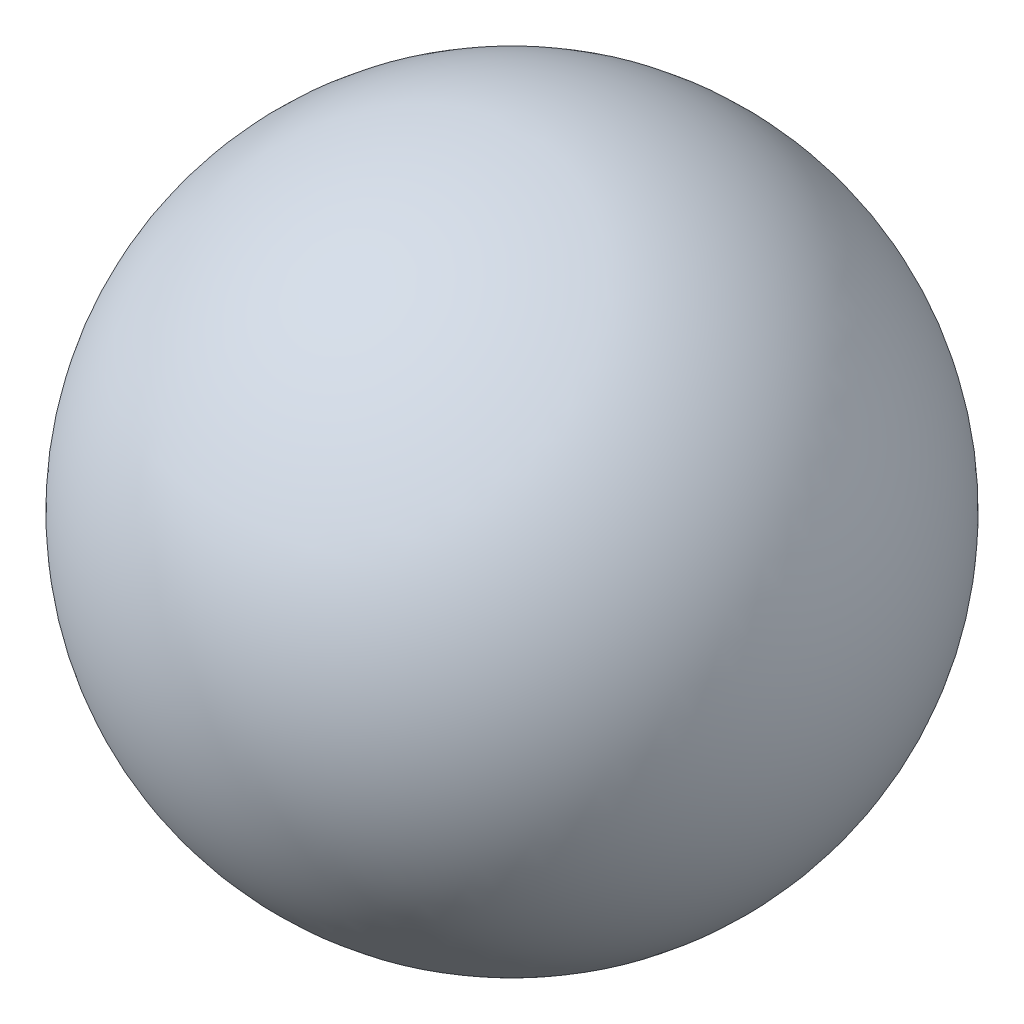
ISO-10303-21;
HEADER;
FILE_DESCRIPTION(('STEP AP214'),'2;1');
FILE_NAME('part.step','',(''),(''),'','','');
FILE_SCHEMA(('AUTOMOTIVE_DESIGN { 1 0 10303 214 1 1 1 1 }'));
ENDSEC;
DATA;
#1=APPLICATION_CONTEXT('core data for automotive mechanical design processes');
#2=APPLICATION_PROTOCOL_DEFINITION('international standard','automotive_design',2000,#1);
#3=PRODUCT_CONTEXT('',#1,'mechanical');
#4=PRODUCT('Part','Part','',(#3));
#5=PRODUCT_RELATED_PRODUCT_CATEGORY('part','',(#4));
#6=PRODUCT_DEFINITION_FORMATION('','',#4);
#7=PRODUCT_DEFINITION_CONTEXT('part definition',#1,'design');
#8=PRODUCT_DEFINITION('design','',#6,#7);
#9=PRODUCT_DEFINITION_SHAPE('','',#8);
#10=(LENGTH_UNIT() NAMED_UNIT(*) SI_UNIT(.MILLI.,.METRE.));
#11=(NAMED_UNIT(*) PLANE_ANGLE_UNIT() SI_UNIT($,.RADIAN.));
#12=(NAMED_UNIT(*) SI_UNIT($,.STERADIAN.) SOLID_ANGLE_UNIT());
#13=UNCERTAINTY_MEASURE_WITH_UNIT(LENGTH_MEASURE(1.E-05),#10,'distance_accuracy_value','');
#14=(GEOMETRIC_REPRESENTATION_CONTEXT(3) GLOBAL_UNCERTAINTY_ASSIGNED_CONTEXT((#13)) GLOBAL_UNIT_ASSIGNED_CONTEXT((#10,
#11,#12)) REPRESENTATION_CONTEXT('',''));
#15=CARTESIAN_POINT('',(0.,0.,0.));
#16=DIRECTION('',(0.,0.,1.));
#17=DIRECTION('',(1.,0.,0.));
#18=AXIS2_PLACEMENT_3D('',#15,#16,#17);
#19=CARTESIAN_POINT('',(1.979580120901,0.,-2.482314956836));
#20=DIRECTION('',(0.,-1.,0.));
#21=DIRECTION('',(0.781831482468035,0.,0.623489801858728));
#22=AXIS2_PLACEMENT_3D('',#19,#20,#21);
#23=SPHERICAL_SURFACE('',#22,0.794);
#24=CARTESIAN_POINT('',(1.979580120901,-0.794,-2.482314956836));
#25=VERTEX_POINT('',#24);
#26=VERTEX_LOOP('',#25);
#27=FACE_BOUND('',#26,.T.);
#28=ADVANCED_FACE('F12',(#27),#23,.T.);
#29=CLOSED_SHELL('',(#28));
#30=MANIFOLD_SOLID_BREP('B1',#29);
#31=ADVANCED_BREP_SHAPE_REPRESENTATION('',(#18,#30),#14);
#32=SHAPE_DEFINITION_REPRESENTATION(#9,#31);
ENDSEC;
END-ISO-10303-21;
